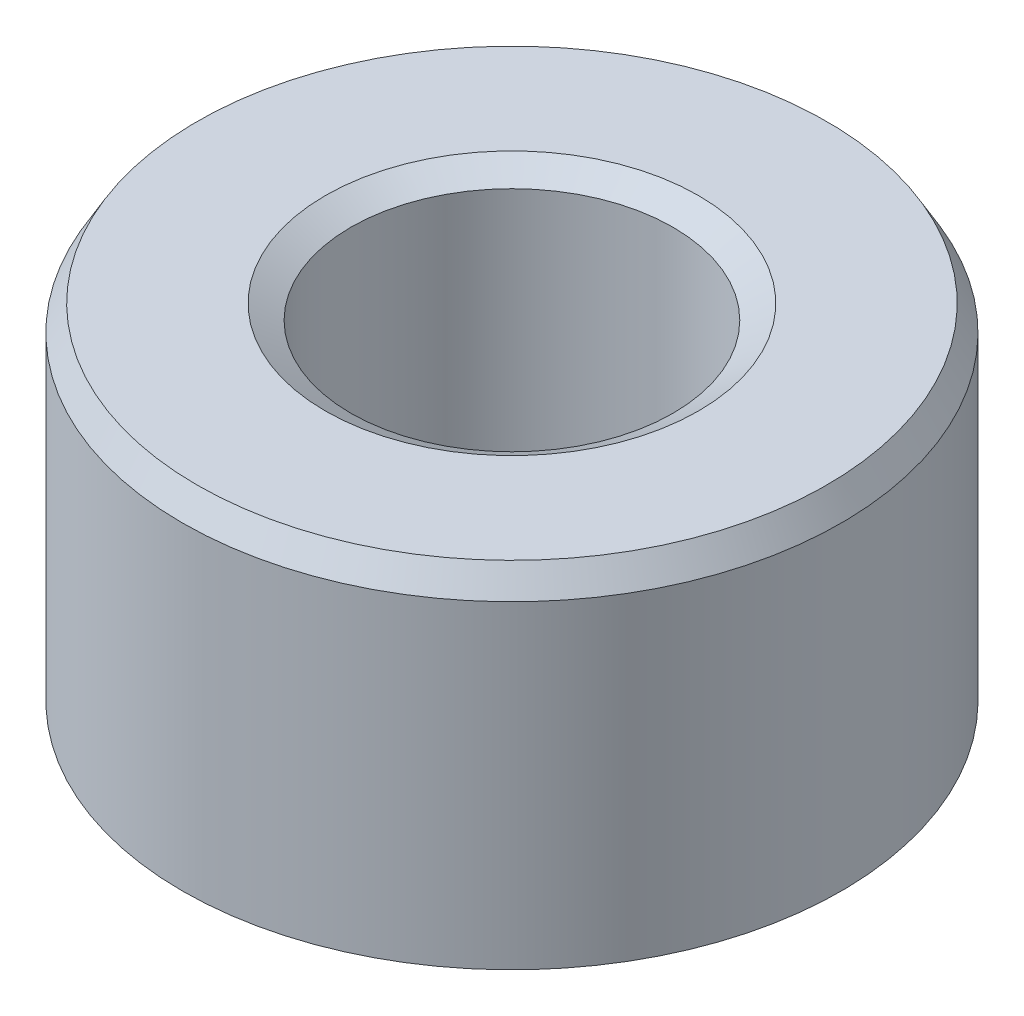
ISO-10303-21;
HEADER;
FILE_DESCRIPTION(('STEP AP214'),'2;1');
FILE_NAME('part.step','',(''),(''),'','','');
FILE_SCHEMA(('AUTOMOTIVE_DESIGN { 1 0 10303 214 1 1 1 1 }'));
ENDSEC;
DATA;
#1=APPLICATION_CONTEXT('core data for automotive mechanical design processes');
#2=APPLICATION_PROTOCOL_DEFINITION('international standard','automotive_design',2000,#1);
#3=PRODUCT_CONTEXT('',#1,'mechanical');
#4=PRODUCT('Part','Part','',(#3));
#5=PRODUCT_RELATED_PRODUCT_CATEGORY('part','',(#4));
#6=PRODUCT_DEFINITION_FORMATION('','',#4);
#7=PRODUCT_DEFINITION_CONTEXT('part definition',#1,'design');
#8=PRODUCT_DEFINITION('design','',#6,#7);
#9=PRODUCT_DEFINITION_SHAPE('','',#8);
#10=(LENGTH_UNIT() NAMED_UNIT(*) SI_UNIT(.MILLI.,.METRE.));
#11=(NAMED_UNIT(*) PLANE_ANGLE_UNIT() SI_UNIT($,.RADIAN.));
#12=(NAMED_UNIT(*) SI_UNIT($,.STERADIAN.) SOLID_ANGLE_UNIT());
#13=UNCERTAINTY_MEASURE_WITH_UNIT(LENGTH_MEASURE(1.E-05),#10,'distance_accuracy_value','');
#14=(GEOMETRIC_REPRESENTATION_CONTEXT(3) GLOBAL_UNCERTAINTY_ASSIGNED_CONTEXT((#13)) GLOBAL_UNIT_ASSIGNED_CONTEXT((#10,
#11,#12)) REPRESENTATION_CONTEXT('',''));
#15=CARTESIAN_POINT('',(0.,0.,0.));
#16=DIRECTION('',(0.,0.,1.));
#17=DIRECTION('',(1.,0.,0.));
#18=AXIS2_PLACEMENT_3D('',#15,#16,#17);
#19=CARTESIAN_POINT('',(0.,32.6711963724019,0.));
#20=DIRECTION('',(0.,-1.,0.));
#21=DIRECTION('',(0.,0.,-1.));
#22=AXIS2_PLACEMENT_3D('',#19,#20,#21);
#23=CYLINDRICAL_SURFACE('',#22,30.);
#24=CARTESIAN_POINT('',(0.,1.33845044716484,0.));
#25=DIRECTION('',(0.,1.,0.));
#26=DIRECTION('',(0.,0.,1.));
#27=AXIS2_PLACEMENT_3D('',#24,#25,#26);
#28=CIRCLE('',#27,30.);
#29=CARTESIAN_POINT('',(0.,1.33845044716484,30.));
#30=VERTEX_POINT('',#29);
#31=EDGE_CURVE('E10',#30,#30,#28,.T.);
#32=ORIENTED_EDGE('',*,*,#31,.T.);
#33=EDGE_LOOP('',(#32));
#34=FACE_BOUND('',#33,.T.);
#35=CARTESIAN_POINT('',(0.,30.3529321944991,0.));
#36=DIRECTION('',(0.,1.,0.));
#37=DIRECTION('',(0.,0.,1.));
#38=AXIS2_PLACEMENT_3D('',#35,#36,#37);
#39=CIRCLE('',#38,30.);
#40=CARTESIAN_POINT('',(0.,30.3529321944991,30.));
#41=VERTEX_POINT('',#40);
#42=EDGE_CURVE('E50',#41,#41,#39,.F.);
#43=ORIENTED_EDGE('',*,*,#42,.T.);
#44=EDGE_LOOP('',(#43));
#45=FACE_BOUND('',#44,.T.);
#46=ADVANCED_FACE('F39',(#34,#45),#23,.T.);
#47=CARTESIAN_POINT('',(0.,32.6711963724019,0.));
#48=DIRECTION('',(0.,1.,0.));
#49=DIRECTION('',(0.,0.,1.));
#50=AXIS2_PLACEMENT_3D('',#47,#48,#49);
#51=PLANE('',#50);
#52=CARTESIAN_POINT('',(0.,32.6711963724019,0.));
#53=DIRECTION('',(0.,1.,0.));
#54=DIRECTION('',(0.,0.,1.));
#55=AXIS2_PLACEMENT_3D('',#52,#53,#54);
#56=CIRCLE('',#55,16.9852516530033);
#57=CARTESIAN_POINT('',(0.,32.6711963724019,16.9852516530033));
#58=VERTEX_POINT('',#57);
#59=EDGE_CURVE('E58',#58,#58,#56,.F.);
#60=ORIENTED_EDGE('',*,*,#59,.T.);
#61=EDGE_LOOP('',(#60));
#62=FACE_BOUND('',#61,.T.);
#63=CARTESIAN_POINT('',(0.,32.6711963724019,0.));
#64=DIRECTION('',(0.,1.,0.));
#65=DIRECTION('',(0.,0.,1.));
#66=AXIS2_PLACEMENT_3D('',#63,#64,#65);
#67=CIRCLE('',#66,28.6615495528351);
#68=CARTESIAN_POINT('',(0.,32.6711963724019,28.6615495528351));
#69=VERTEX_POINT('',#68);
#70=EDGE_CURVE('E61',#69,#69,#67,.T.);
#71=ORIENTED_EDGE('',*,*,#70,.T.);
#72=EDGE_LOOP('',(#71));
#73=FACE_BOUND('',#72,.T.);
#74=ADVANCED_FACE('F88',(#62,#73),#51,.T.);
#75=CARTESIAN_POINT('',(0.,0.,0.));
#76=DIRECTION('',(0.,1.,0.));
#77=DIRECTION('',(0.,0.,1.));
#78=AXIS2_PLACEMENT_3D('',#75,#76,#77);
#79=PLANE('',#78);
#80=CARTESIAN_POINT('',(0.,0.,0.));
#81=DIRECTION('',(0.,1.,0.));
#82=DIRECTION('',(0.,0.,1.));
#83=AXIS2_PLACEMENT_3D('',#80,#81,#82);
#84=CIRCLE('',#83,16.0054379222653);
#85=CARTESIAN_POINT('',(0.,0.,16.0054379222653));
#86=VERTEX_POINT('',#85);
#87=EDGE_CURVE('E51',#86,#86,#84,.T.);
#88=ORIENTED_EDGE('',*,*,#87,.T.);
#89=EDGE_LOOP('',(#88));
#90=FACE_BOUND('',#89,.T.);
#91=CARTESIAN_POINT('',(0.,0.,0.));
#92=DIRECTION('',(0.,1.,0.));
#93=DIRECTION('',(0.,0.,1.));
#94=AXIS2_PLACEMENT_3D('',#91,#92,#93);
#95=CIRCLE('',#94,27.6817358220972);
#96=CARTESIAN_POINT('',(0.,0.,27.6817358220972));
#97=VERTEX_POINT('',#96);
#98=EDGE_CURVE('E54',#97,#97,#95,.F.);
#99=ORIENTED_EDGE('',*,*,#98,.T.);
#100=EDGE_LOOP('',(#99));
#101=FACE_BOUND('',#100,.T.);
#102=ADVANCED_FACE('F83',(#90,#101),#79,.F.);
#103=CARTESIAN_POINT('',(0.,32.6711963724019,0.));
#104=DIRECTION('',(0.,-1.,0.));
#105=DIRECTION('',(0.,0.,-1.));
#106=AXIS2_PLACEMENT_3D('',#103,#104,#105);
#107=CYLINDRICAL_SURFACE('',#106,14.6669874751004);
#108=CARTESIAN_POINT('',(0.,31.3327459252371,0.));
#109=DIRECTION('',(0.,1.,0.));
#110=DIRECTION('',(0.,0.,1.));
#111=AXIS2_PLACEMENT_3D('',#108,#109,#110);
#112=CIRCLE('',#111,14.6669874751004);
#113=CARTESIAN_POINT('',(0.,31.3327459252371,14.6669874751004));
#114=VERTEX_POINT('',#113);
#115=EDGE_CURVE('E67',#114,#114,#112,.T.);
#116=ORIENTED_EDGE('',*,*,#115,.T.);
#117=EDGE_LOOP('',(#116));
#118=FACE_BOUND('',#117,.T.);
#119=CARTESIAN_POINT('',(0.,2.31826417790282,0.));
#120=DIRECTION('',(0.,1.,0.));
#121=DIRECTION('',(0.,0.,1.));
#122=AXIS2_PLACEMENT_3D('',#119,#120,#121);
#123=CIRCLE('',#122,14.6669874751004);
#124=CARTESIAN_POINT('',(0.,2.31826417790282,14.6669874751004));
#125=VERTEX_POINT('',#124);
#126=EDGE_CURVE('E69',#125,#125,#123,.F.);
#127=ORIENTED_EDGE('',*,*,#126,.T.);
#128=EDGE_LOOP('',(#127));
#129=FACE_BOUND('',#128,.T.);
#130=ADVANCED_FACE('F71',(#118,#129),#107,.F.);
#131=CARTESIAN_POINT('',(0.,31.3327459252371,0.));
#132=DIRECTION('',(0.,1.,0.));
#133=DIRECTION('',(0.,0.,1.));
#134=AXIS2_PLACEMENT_3D('',#131,#132,#133);
#135=CONICAL_SURFACE('',#134,14.6669874751004,1.0471975511966);
#136=ORIENTED_EDGE('',*,*,#59,.F.);
#137=EDGE_LOOP('',(#136));
#138=FACE_BOUND('',#137,.T.);
#139=ORIENTED_EDGE('',*,*,#115,.F.);
#140=EDGE_LOOP('',(#139));
#141=FACE_BOUND('',#140,.T.);
#142=ADVANCED_FACE('F77',(#138,#141),#135,.F.);
#143=CARTESIAN_POINT('',(0.,0.,0.));
#144=DIRECTION('',(0.,-1.,0.));
#145=DIRECTION('',(0.,0.,-1.));
#146=AXIS2_PLACEMENT_3D('',#143,#144,#145);
#147=CONICAL_SURFACE('',#146,16.0054379222653,0.523598775598295);
#148=ORIENTED_EDGE('',*,*,#126,.F.);
#149=EDGE_LOOP('',(#148));
#150=FACE_BOUND('',#149,.T.);
#151=ORIENTED_EDGE('',*,*,#87,.F.);
#152=EDGE_LOOP('',(#151));
#153=FACE_BOUND('',#152,.T.);
#154=ADVANCED_FACE('F73',(#150,#153),#147,.F.);
#155=CARTESIAN_POINT('',(0.,1.33845044716484,0.));
#156=DIRECTION('',(0.,1.,0.));
#157=DIRECTION('',(0.,0.,1.));
#158=AXIS2_PLACEMENT_3D('',#155,#156,#157);
#159=CONICAL_SURFACE('',#158,30.,1.0471975511966);
#160=ORIENTED_EDGE('',*,*,#98,.F.);
#161=EDGE_LOOP('',(#160));
#162=FACE_BOUND('',#161,.T.);
#163=ORIENTED_EDGE('',*,*,#31,.F.);
#164=EDGE_LOOP('',(#163));
#165=FACE_BOUND('',#164,.T.);
#166=ADVANCED_FACE('F76',(#162,#165),#159,.T.);
#167=CARTESIAN_POINT('',(0.,32.6711963724019,0.));
#168=DIRECTION('',(0.,-1.,0.));
#169=DIRECTION('',(0.,0.,-1.));
#170=AXIS2_PLACEMENT_3D('',#167,#168,#169);
#171=CONICAL_SURFACE('',#170,28.6615495528351,0.523598775598299);
#172=ORIENTED_EDGE('',*,*,#42,.F.);
#173=EDGE_LOOP('',(#172));
#174=FACE_BOUND('',#173,.T.);
#175=ORIENTED_EDGE('',*,*,#70,.F.);
#176=EDGE_LOOP('',(#175));
#177=FACE_BOUND('',#176,.T.);
#178=ADVANCED_FACE('F45',(#174,#177),#171,.T.);
#179=CLOSED_SHELL('',(#46,#74,#102,#130,#142,#154,#166,#178));
#180=MANIFOLD_SOLID_BREP('B2',#179);
#181=ADVANCED_BREP_SHAPE_REPRESENTATION('',(#18,#180),#14);
#182=SHAPE_DEFINITION_REPRESENTATION(#9,#181);
ENDSEC;
END-ISO-10303-21;
